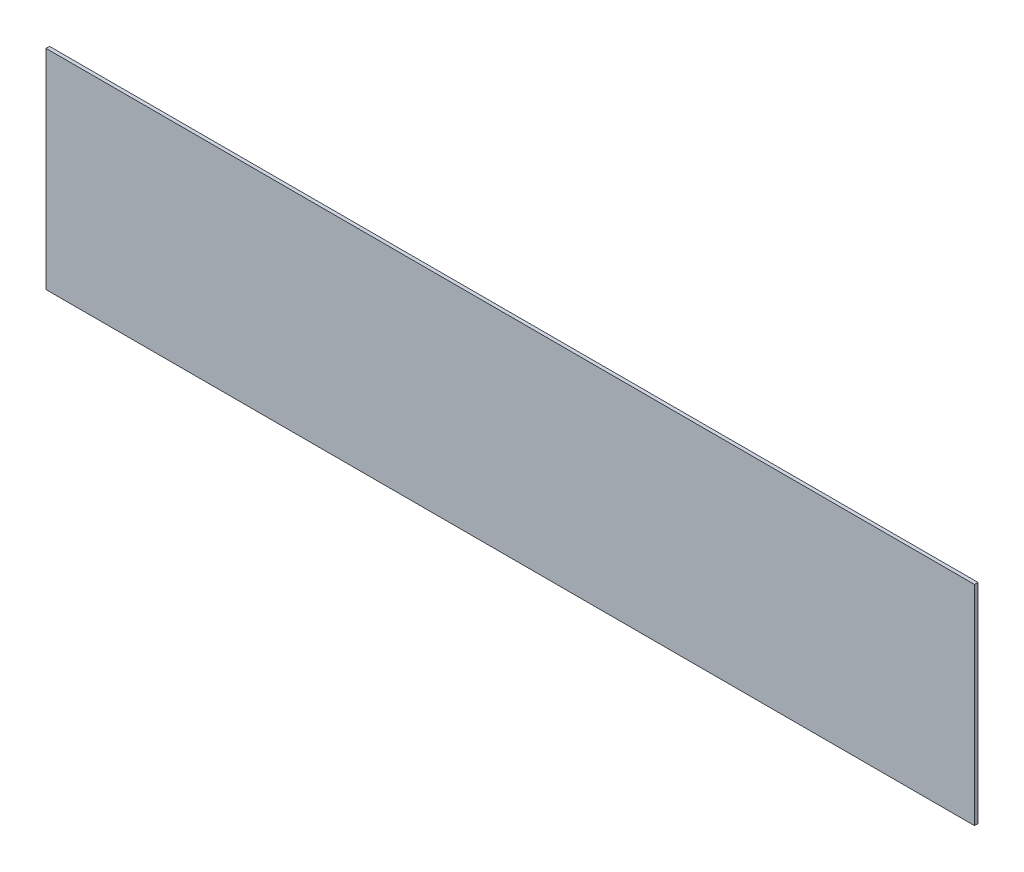
ISO-10303-21;
HEADER;
FILE_DESCRIPTION(('STEP AP214'),'2;1');
FILE_NAME('part.step','',(''),(''),'','','');
FILE_SCHEMA(('AUTOMOTIVE_DESIGN { 1 0 10303 214 1 1 1 1 }'));
ENDSEC;
DATA;
#1=APPLICATION_CONTEXT('core data for automotive mechanical design processes');
#2=APPLICATION_PROTOCOL_DEFINITION('international standard','automotive_design',2000,#1);
#3=PRODUCT_CONTEXT('',#1,'mechanical');
#4=PRODUCT('Part','Part','',(#3));
#5=PRODUCT_RELATED_PRODUCT_CATEGORY('part','',(#4));
#6=PRODUCT_DEFINITION_FORMATION('','',#4);
#7=PRODUCT_DEFINITION_CONTEXT('part definition',#1,'design');
#8=PRODUCT_DEFINITION('design','',#6,#7);
#9=PRODUCT_DEFINITION_SHAPE('','',#8);
#10=(LENGTH_UNIT() NAMED_UNIT(*) SI_UNIT(.MILLI.,.METRE.));
#11=(NAMED_UNIT(*) PLANE_ANGLE_UNIT() SI_UNIT($,.RADIAN.));
#12=(NAMED_UNIT(*) SI_UNIT($,.STERADIAN.) SOLID_ANGLE_UNIT());
#13=UNCERTAINTY_MEASURE_WITH_UNIT(LENGTH_MEASURE(1.E-05),#10,'distance_accuracy_value','');
#14=(GEOMETRIC_REPRESENTATION_CONTEXT(3) GLOBAL_UNCERTAINTY_ASSIGNED_CONTEXT((#13)) GLOBAL_UNIT_ASSIGNED_CONTEXT((#10,
#11,#12)) REPRESENTATION_CONTEXT('',''));
#15=CARTESIAN_POINT('',(0.,0.,0.));
#16=DIRECTION('',(0.,0.,1.));
#17=DIRECTION('',(1.,0.,0.));
#18=AXIS2_PLACEMENT_3D('',#15,#16,#17);
#19=CARTESIAN_POINT('',(-269.032324472283,14.780316344464,1.5));
#20=DIRECTION('',(1.,0.,0.));
#21=DIRECTION('',(0.,0.,-1.));
#22=AXIS2_PLACEMENT_3D('',#19,#20,#21);
#23=PLANE('',#22);
#24=DIRECTION('',(0.,-1.,0.));
#25=VECTOR('',#24,1.);
#26=CARTESIAN_POINT('',(-269.032324472283,14.780316344464,0.));
#27=LINE('',#26,#25);
#28=CARTESIAN_POINT('',(-269.032324472283,14.780316344464,0.));
#29=VERTEX_POINT('',#28);
#30=CARTESIAN_POINT('',(-269.032324472283,-75.219683655536,0.));
#31=VERTEX_POINT('',#30);
#32=EDGE_CURVE('E99',#29,#31,#27,.T.);
#33=ORIENTED_EDGE('',*,*,#32,.T.);
#34=DIRECTION('',(0.,0.,-1.));
#35=VECTOR('',#34,1.);
#36=CARTESIAN_POINT('',(-269.032324472283,-75.219683655536,1.5));
#37=LINE('',#36,#35);
#38=CARTESIAN_POINT('',(-269.032324472283,-75.219683655536,1.5));
#39=VERTEX_POINT('',#38);
#40=EDGE_CURVE('E11',#39,#31,#37,.T.);
#41=ORIENTED_EDGE('',*,*,#40,.F.);
#42=DIRECTION('',(0.,-1.,0.));
#43=VECTOR('',#42,1.);
#44=CARTESIAN_POINT('',(-269.032324472283,14.780316344464,1.5));
#45=LINE('',#44,#43);
#46=CARTESIAN_POINT('',(-269.032324472283,14.780316344464,1.5));
#47=VERTEX_POINT('',#46);
#48=EDGE_CURVE('E87',#47,#39,#45,.T.);
#49=ORIENTED_EDGE('',*,*,#48,.F.);
#50=DIRECTION('',(0.,0.,-1.));
#51=VECTOR('',#50,1.);
#52=CARTESIAN_POINT('',(-269.032324472283,14.780316344464,1.5));
#53=LINE('',#52,#51);
#54=EDGE_CURVE('E95',#47,#29,#53,.T.);
#55=ORIENTED_EDGE('',*,*,#54,.T.);
#56=EDGE_LOOP('',(#33,#41,#49,#55));
#57=FACE_BOUND('',#56,.T.);
#58=ADVANCED_FACE('F36',(#57),#23,.F.);
#59=CARTESIAN_POINT('',(-269.032324472283,-75.219683655536,1.5));
#60=DIRECTION('',(0.,1.,0.));
#61=DIRECTION('',(0.,0.,1.));
#62=AXIS2_PLACEMENT_3D('',#59,#60,#61);
#63=PLANE('',#62);
#64=DIRECTION('',(1.,0.,0.));
#65=VECTOR('',#64,1.);
#66=CARTESIAN_POINT('',(-269.032324472283,-75.219683655536,0.));
#67=LINE('',#66,#65);
#68=CARTESIAN_POINT('',(130.967675527717,-75.219683655536,0.));
#69=VERTEX_POINT('',#68);
#70=EDGE_CURVE('E91',#31,#69,#67,.T.);
#71=ORIENTED_EDGE('',*,*,#70,.T.);
#72=DIRECTION('',(0.,0.,-1.));
#73=VECTOR('',#72,1.);
#74=CARTESIAN_POINT('',(130.967675527717,-75.219683655536,1.5));
#75=LINE('',#74,#73);
#76=CARTESIAN_POINT('',(130.967675527717,-75.219683655536,1.5));
#77=VERTEX_POINT('',#76);
#78=EDGE_CURVE('E44',#77,#69,#75,.T.);
#79=ORIENTED_EDGE('',*,*,#78,.F.);
#80=DIRECTION('',(1.,0.,0.));
#81=VECTOR('',#80,1.);
#82=CARTESIAN_POINT('',(-269.032324472283,-75.219683655536,1.5));
#83=LINE('',#82,#81);
#84=EDGE_CURVE('E82',#39,#77,#83,.T.);
#85=ORIENTED_EDGE('',*,*,#84,.F.);
#86=ORIENTED_EDGE('',*,*,#40,.T.);
#87=EDGE_LOOP('',(#71,#79,#85,#86));
#88=FACE_BOUND('',#87,.T.);
#89=ADVANCED_FACE('F90',(#88),#63,.F.);
#90=CARTESIAN_POINT('',(130.967675527717,14.780316344464,1.5));
#91=DIRECTION('',(-1.,0.,0.));
#92=DIRECTION('',(0.,-1.,0.));
#93=AXIS2_PLACEMENT_3D('',#90,#91,#92);
#94=PLANE('',#93);
#95=DIRECTION('',(0.,1.,0.));
#96=VECTOR('',#95,1.);
#97=CARTESIAN_POINT('',(130.967675527717,14.780316344464,0.));
#98=LINE('',#97,#96);
#99=CARTESIAN_POINT('',(130.967675527717,14.780316344464,0.));
#100=VERTEX_POINT('',#99);
#101=EDGE_CURVE('E69',#69,#100,#98,.T.);
#102=ORIENTED_EDGE('',*,*,#101,.T.);
#103=DIRECTION('',(0.,0.,-1.));
#104=VECTOR('',#103,1.);
#105=CARTESIAN_POINT('',(130.967675527717,14.780316344464,1.5));
#106=LINE('',#105,#104);
#107=CARTESIAN_POINT('',(130.967675527717,14.780316344464,1.5));
#108=VERTEX_POINT('',#107);
#109=EDGE_CURVE('E92',#108,#100,#106,.T.);
#110=ORIENTED_EDGE('',*,*,#109,.F.);
#111=DIRECTION('',(0.,1.,0.));
#112=VECTOR('',#111,1.);
#113=CARTESIAN_POINT('',(130.967675527717,14.780316344464,1.5));
#114=LINE('',#113,#112);
#115=EDGE_CURVE('E85',#77,#108,#114,.T.);
#116=ORIENTED_EDGE('',*,*,#115,.F.);
#117=ORIENTED_EDGE('',*,*,#78,.T.);
#118=EDGE_LOOP('',(#102,#110,#116,#117));
#119=FACE_BOUND('',#118,.T.);
#120=ADVANCED_FACE('F93',(#119),#94,.F.);
#121=CARTESIAN_POINT('',(-269.032324472283,14.780316344464,1.5));
#122=DIRECTION('',(0.,-1.,0.));
#123=DIRECTION('',(0.,0.,-1.));
#124=AXIS2_PLACEMENT_3D('',#121,#122,#123);
#125=PLANE('',#124);
#126=DIRECTION('',(-1.,0.,0.));
#127=VECTOR('',#126,1.);
#128=CARTESIAN_POINT('',(-269.032324472283,14.780316344464,0.));
#129=LINE('',#128,#127);
#130=EDGE_CURVE('E75',#100,#29,#129,.T.);
#131=ORIENTED_EDGE('',*,*,#130,.T.);
#132=ORIENTED_EDGE('',*,*,#54,.F.);
#133=DIRECTION('',(-1.,0.,0.));
#134=VECTOR('',#133,1.);
#135=CARTESIAN_POINT('',(-269.032324472283,14.780316344464,1.5));
#136=LINE('',#135,#134);
#137=EDGE_CURVE('E52',#108,#47,#136,.T.);
#138=ORIENTED_EDGE('',*,*,#137,.F.);
#139=ORIENTED_EDGE('',*,*,#109,.T.);
#140=EDGE_LOOP('',(#131,#132,#138,#139));
#141=FACE_BOUND('',#140,.T.);
#142=ADVANCED_FACE('F106',(#141),#125,.F.);
#143=CARTESIAN_POINT('',(0.,0.,1.5));
#144=DIRECTION('',(0.,0.,1.));
#145=DIRECTION('',(1.,0.,0.));
#146=AXIS2_PLACEMENT_3D('',#143,#144,#145);
#147=PLANE('',#146);
#148=ORIENTED_EDGE('',*,*,#48,.T.);
#149=ORIENTED_EDGE('',*,*,#84,.T.);
#150=ORIENTED_EDGE('',*,*,#115,.T.);
#151=ORIENTED_EDGE('',*,*,#137,.T.);
#152=EDGE_LOOP('',(#148,#149,#150,#151));
#153=FACE_BOUND('',#152,.T.);
#154=ADVANCED_FACE('F83',(#153),#147,.T.);
#155=CARTESIAN_POINT('',(0.,0.,0.));
#156=DIRECTION('',(0.,0.,1.));
#157=DIRECTION('',(1.,0.,0.));
#158=AXIS2_PLACEMENT_3D('',#155,#156,#157);
#159=PLANE('',#158);
#160=ORIENTED_EDGE('',*,*,#32,.F.);
#161=ORIENTED_EDGE('',*,*,#130,.F.);
#162=ORIENTED_EDGE('',*,*,#101,.F.);
#163=ORIENTED_EDGE('',*,*,#70,.F.);
#164=EDGE_LOOP('',(#160,#161,#162,#163));
#165=FACE_BOUND('',#164,.T.);
#166=ADVANCED_FACE('F109',(#165),#159,.F.);
#167=CLOSED_SHELL('',(#58,#89,#120,#142,#154,#166));
#168=MANIFOLD_SOLID_BREP('B2',#167);
#169=ADVANCED_BREP_SHAPE_REPRESENTATION('',(#18,#168),#14);
#170=SHAPE_DEFINITION_REPRESENTATION(#9,#169);
ENDSEC;
END-ISO-10303-21;
